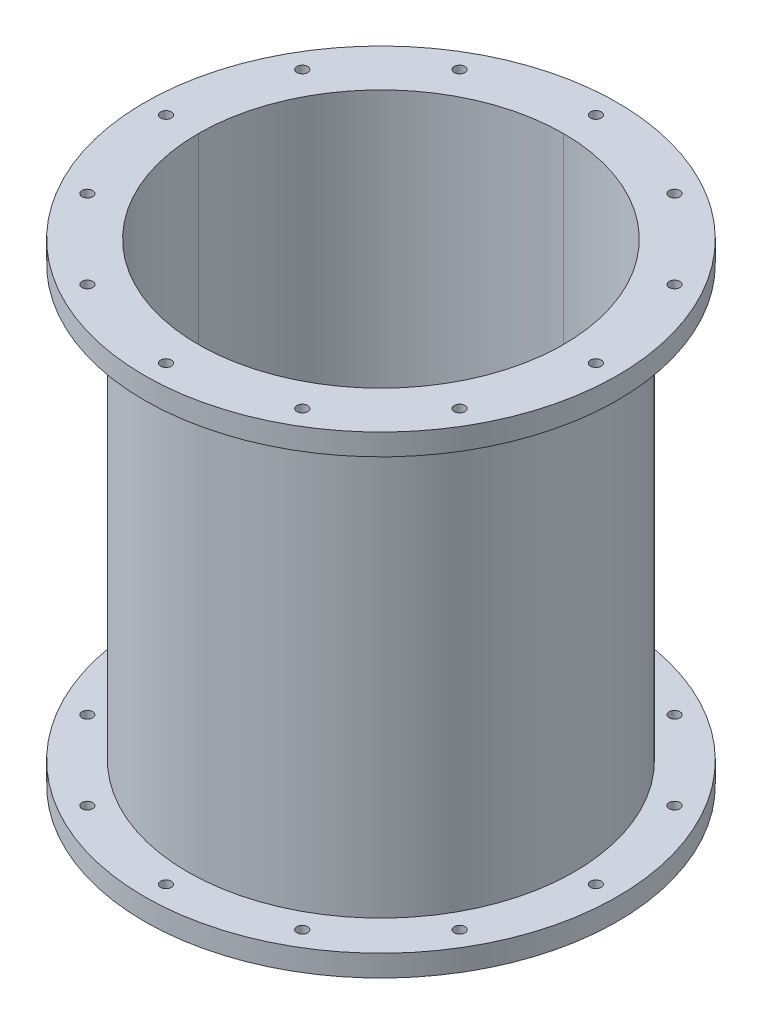
ISO-10303-21;
HEADER;
FILE_DESCRIPTION(('STEP AP214'),'2;1');
FILE_NAME('part.step','',(''),(''),'','','');
FILE_SCHEMA(('AUTOMOTIVE_DESIGN { 1 0 10303 214 1 1 1 1 }'));
ENDSEC;
DATA;
#1=APPLICATION_CONTEXT('core data for automotive mechanical design processes');
#2=APPLICATION_PROTOCOL_DEFINITION('international standard','automotive_design',2000,#1);
#3=PRODUCT_CONTEXT('',#1,'mechanical');
#4=PRODUCT('Part','Part','',(#3));
#5=PRODUCT_RELATED_PRODUCT_CATEGORY('part','',(#4));
#6=PRODUCT_DEFINITION_FORMATION('','',#4);
#7=PRODUCT_DEFINITION_CONTEXT('part definition',#1,'design');
#8=PRODUCT_DEFINITION('design','',#6,#7);
#9=PRODUCT_DEFINITION_SHAPE('','',#8);
#10=(LENGTH_UNIT() NAMED_UNIT(*) SI_UNIT(.MILLI.,.METRE.));
#11=(NAMED_UNIT(*) PLANE_ANGLE_UNIT() SI_UNIT($,.RADIAN.));
#12=(NAMED_UNIT(*) SI_UNIT($,.STERADIAN.) SOLID_ANGLE_UNIT());
#13=UNCERTAINTY_MEASURE_WITH_UNIT(LENGTH_MEASURE(1.E-05),#10,'distance_accuracy_value','');
#14=(GEOMETRIC_REPRESENTATION_CONTEXT(3) GLOBAL_UNCERTAINTY_ASSIGNED_CONTEXT((#13)) GLOBAL_UNIT_ASSIGNED_CONTEXT((#10,
#11,#12)) REPRESENTATION_CONTEXT('',''));
#15=CARTESIAN_POINT('',(0.,0.,0.));
#16=DIRECTION('',(0.,0.,1.));
#17=DIRECTION('',(1.,0.,0.));
#18=AXIS2_PLACEMENT_3D('',#15,#16,#17);
#19=CARTESIAN_POINT('',(109.985226280624,139.7,63.5));
#20=DIRECTION('',(0.,-1.,0.));
#21=DIRECTION('',(0.,0.,-1.));
#22=AXIS2_PLACEMENT_3D('',#19,#20,#21);
#23=CYLINDRICAL_SURFACE('',#22,3.17499999999937);
#24=CARTESIAN_POINT('',(109.985226280624,-139.7,63.5));
#25=DIRECTION('',(0.,1.,0.));
#26=DIRECTION('',(0.,0.,1.));
#27=AXIS2_PLACEMENT_3D('',#24,#25,#26);
#28=CIRCLE('',#27,3.17499999999937);
#29=CARTESIAN_POINT('',(109.985226280624,-139.7,66.6749999999993));
#30=VERTEX_POINT('',#29);
#31=EDGE_CURVE('E157',#30,#30,#28,.T.);
#32=ORIENTED_EDGE('',*,*,#31,.F.);
#33=EDGE_LOOP('',(#32));
#34=FACE_BOUND('',#33,.T.);
#35=CARTESIAN_POINT('',(109.985226280624,-127.,63.5));
#36=DIRECTION('',(0.,1.,0.));
#37=DIRECTION('',(0.,0.,1.));
#38=AXIS2_PLACEMENT_3D('',#35,#36,#37);
#39=CIRCLE('',#38,3.17499999999937);
#40=CARTESIAN_POINT('',(109.985226280624,-127.,66.6749999999993));
#41=VERTEX_POINT('',#40);
#42=EDGE_CURVE('E246',#41,#41,#39,.T.);
#43=ORIENTED_EDGE('',*,*,#42,.T.);
#44=EDGE_LOOP('',(#43));
#45=FACE_BOUND('',#44,.T.);
#46=ADVANCED_FACE('F48',(#34,#45),#23,.F.);
#47=CARTESIAN_POINT('',(63.5,139.7,109.985226280624));
#48=DIRECTION('',(0.,-1.,0.));
#49=DIRECTION('',(0.,0.,-1.));
#50=AXIS2_PLACEMENT_3D('',#47,#48,#49);
#51=CYLINDRICAL_SURFACE('',#50,3.17499999999938);
#52=CARTESIAN_POINT('',(63.5,-139.7,109.985226280624));
#53=DIRECTION('',(0.,1.,0.));
#54=DIRECTION('',(0.,0.,1.));
#55=AXIS2_PLACEMENT_3D('',#52,#53,#54);
#56=CIRCLE('',#55,3.17499999999938);
#57=CARTESIAN_POINT('',(63.5,-139.7,113.160226280623));
#58=VERTEX_POINT('',#57);
#59=EDGE_CURVE('E153',#58,#58,#56,.T.);
#60=ORIENTED_EDGE('',*,*,#59,.F.);
#61=EDGE_LOOP('',(#60));
#62=FACE_BOUND('',#61,.T.);
#63=CARTESIAN_POINT('',(63.5,-127.,109.985226280624));
#64=DIRECTION('',(0.,1.,0.));
#65=DIRECTION('',(0.,0.,1.));
#66=AXIS2_PLACEMENT_3D('',#63,#64,#65);
#67=CIRCLE('',#66,3.17499999999939);
#68=CARTESIAN_POINT('',(63.5,-127.,113.160226280623));
#69=VERTEX_POINT('',#68);
#70=EDGE_CURVE('E256',#69,#69,#67,.T.);
#71=ORIENTED_EDGE('',*,*,#70,.T.);
#72=EDGE_LOOP('',(#71));
#73=FACE_BOUND('',#72,.T.);
#74=ADVANCED_FACE('F184',(#62,#73),#51,.F.);
#75=CARTESIAN_POINT('',(127.,139.7,0.));
#76=DIRECTION('',(0.,-1.,0.));
#77=DIRECTION('',(0.,0.,-1.));
#78=AXIS2_PLACEMENT_3D('',#75,#76,#77);
#79=CYLINDRICAL_SURFACE('',#78,3.175);
#80=CARTESIAN_POINT('',(127.,-139.7,0.));
#81=DIRECTION('',(0.,1.,0.));
#82=DIRECTION('',(0.,0.,1.));
#83=AXIS2_PLACEMENT_3D('',#80,#81,#82);
#84=CIRCLE('',#83,3.175);
#85=CARTESIAN_POINT('',(127.,-139.7,3.175));
#86=VERTEX_POINT('',#85);
#87=EDGE_CURVE('E147',#86,#86,#84,.T.);
#88=ORIENTED_EDGE('',*,*,#87,.F.);
#89=EDGE_LOOP('',(#88));
#90=FACE_BOUND('',#89,.T.);
#91=CARTESIAN_POINT('',(127.,-127.,0.));
#92=DIRECTION('',(0.,1.,0.));
#93=DIRECTION('',(0.,0.,1.));
#94=AXIS2_PLACEMENT_3D('',#91,#92,#93);
#95=CIRCLE('',#94,3.175);
#96=CARTESIAN_POINT('',(127.,-127.,3.175));
#97=VERTEX_POINT('',#96);
#98=EDGE_CURVE('E239',#97,#97,#95,.T.);
#99=ORIENTED_EDGE('',*,*,#98,.T.);
#100=EDGE_LOOP('',(#99));
#101=FACE_BOUND('',#100,.T.);
#102=ADVANCED_FACE('F190',(#90,#101),#79,.F.);
#103=CARTESIAN_POINT('',(63.5,139.7,-109.985226280624));
#104=DIRECTION('',(0.,-1.,0.));
#105=DIRECTION('',(0.,0.,-1.));
#106=AXIS2_PLACEMENT_3D('',#103,#104,#105);
#107=CYLINDRICAL_SURFACE('',#106,3.17499999999933);
#108=CARTESIAN_POINT('',(63.5,-139.7,-109.985226280624));
#109=DIRECTION('',(0.,1.,0.));
#110=DIRECTION('',(0.,0.,1.));
#111=AXIS2_PLACEMENT_3D('',#108,#109,#110);
#112=CIRCLE('',#111,3.17499999999933);
#113=CARTESIAN_POINT('',(63.5,-139.7,-106.810226280624));
#114=VERTEX_POINT('',#113);
#115=EDGE_CURVE('E143',#114,#114,#112,.T.);
#116=ORIENTED_EDGE('',*,*,#115,.F.);
#117=EDGE_LOOP('',(#116));
#118=FACE_BOUND('',#117,.T.);
#119=CARTESIAN_POINT('',(63.5,-127.,-109.985226280624));
#120=DIRECTION('',(0.,1.,0.));
#121=DIRECTION('',(0.,0.,1.));
#122=AXIS2_PLACEMENT_3D('',#119,#120,#121);
#123=CIRCLE('',#122,3.17499999999933);
#124=CARTESIAN_POINT('',(63.5,-127.,-106.810226280624));
#125=VERTEX_POINT('',#124);
#126=EDGE_CURVE('E240',#125,#125,#123,.T.);
#127=ORIENTED_EDGE('',*,*,#126,.T.);
#128=EDGE_LOOP('',(#127));
#129=FACE_BOUND('',#128,.T.);
#130=ADVANCED_FACE('F394',(#118,#129),#107,.F.);
#131=CARTESIAN_POINT('',(-63.5,139.7,109.985226280624));
#132=DIRECTION('',(0.,-1.,0.));
#133=DIRECTION('',(0.,0.,-1.));
#134=AXIS2_PLACEMENT_3D('',#131,#132,#133);
#135=CYLINDRICAL_SURFACE('',#134,3.17499999999984);
#136=CARTESIAN_POINT('',(-63.5,-139.7,109.985226280624));
#137=DIRECTION('',(0.,1.,0.));
#138=DIRECTION('',(0.,0.,1.));
#139=AXIS2_PLACEMENT_3D('',#136,#137,#138);
#140=CIRCLE('',#139,3.17499999999984);
#141=CARTESIAN_POINT('',(-63.5,-139.7,113.160226280624));
#142=VERTEX_POINT('',#141);
#143=EDGE_CURVE('E139',#142,#142,#140,.T.);
#144=ORIENTED_EDGE('',*,*,#143,.F.);
#145=EDGE_LOOP('',(#144));
#146=FACE_BOUND('',#145,.T.);
#147=CARTESIAN_POINT('',(-63.5,-127.,109.985226280624));
#148=DIRECTION('',(0.,1.,0.));
#149=DIRECTION('',(0.,0.,1.));
#150=AXIS2_PLACEMENT_3D('',#147,#148,#149);
#151=CIRCLE('',#150,3.17499999999983);
#152=CARTESIAN_POINT('',(-63.5,-127.,113.160226280624));
#153=VERTEX_POINT('',#152);
#154=EDGE_CURVE('E264',#153,#153,#151,.T.);
#155=ORIENTED_EDGE('',*,*,#154,.T.);
#156=EDGE_LOOP('',(#155));
#157=FACE_BOUND('',#156,.T.);
#158=ADVANCED_FACE('F401',(#146,#157),#135,.F.);
#159=CARTESIAN_POINT('',(-109.985226280624,139.7,63.5000000000001));
#160=DIRECTION('',(0.,-1.,0.));
#161=DIRECTION('',(0.,0.,-1.));
#162=AXIS2_PLACEMENT_3D('',#159,#160,#161);
#163=CYLINDRICAL_SURFACE('',#162,3.17499999999986);
#164=CARTESIAN_POINT('',(-109.985226280624,-139.7,63.5000000000001));
#165=DIRECTION('',(0.,1.,0.));
#166=DIRECTION('',(0.,0.,1.));
#167=AXIS2_PLACEMENT_3D('',#164,#165,#166);
#168=CIRCLE('',#167,3.17499999999986);
#169=CARTESIAN_POINT('',(-109.985226280624,-139.7,66.6749999999999));
#170=VERTEX_POINT('',#169);
#171=EDGE_CURVE('E135',#170,#170,#168,.T.);
#172=ORIENTED_EDGE('',*,*,#171,.F.);
#173=EDGE_LOOP('',(#172));
#174=FACE_BOUND('',#173,.T.);
#175=CARTESIAN_POINT('',(-109.985226280624,-127.,63.5000000000001));
#176=DIRECTION('',(0.,1.,0.));
#177=DIRECTION('',(0.,0.,1.));
#178=AXIS2_PLACEMENT_3D('',#175,#176,#177);
#179=CIRCLE('',#178,3.17499999999985);
#180=CARTESIAN_POINT('',(-109.985226280624,-127.,66.6749999999999));
#181=VERTEX_POINT('',#180);
#182=EDGE_CURVE('E268',#181,#181,#179,.T.);
#183=ORIENTED_EDGE('',*,*,#182,.T.);
#184=EDGE_LOOP('',(#183));
#185=FACE_BOUND('',#184,.T.);
#186=ADVANCED_FACE('F480',(#174,#185),#163,.F.);
#187=CARTESIAN_POINT('',(0.,139.7,127.));
#188=DIRECTION('',(0.,-1.,0.));
#189=DIRECTION('',(0.,0.,-1.));
#190=AXIS2_PLACEMENT_3D('',#187,#188,#189);
#191=CYLINDRICAL_SURFACE('',#190,3.17499999999936);
#192=CARTESIAN_POINT('',(0.,-139.7,127.));
#193=DIRECTION('',(0.,1.,0.));
#194=DIRECTION('',(0.,0.,1.));
#195=AXIS2_PLACEMENT_3D('',#192,#193,#194);
#196=CIRCLE('',#195,3.17499999999936);
#197=CARTESIAN_POINT('',(0.,-139.7,130.174999999999));
#198=VERTEX_POINT('',#197);
#199=EDGE_CURVE('E131',#198,#198,#196,.T.);
#200=ORIENTED_EDGE('',*,*,#199,.F.);
#201=EDGE_LOOP('',(#200));
#202=FACE_BOUND('',#201,.T.);
#203=CARTESIAN_POINT('',(0.,-127.,127.));
#204=DIRECTION('',(0.,1.,0.));
#205=DIRECTION('',(0.,0.,1.));
#206=AXIS2_PLACEMENT_3D('',#203,#204,#205);
#207=CIRCLE('',#206,3.17499999999938);
#208=CARTESIAN_POINT('',(0.,-127.,130.174999999999));
#209=VERTEX_POINT('',#208);
#210=EDGE_CURVE('E260',#209,#209,#207,.T.);
#211=ORIENTED_EDGE('',*,*,#210,.T.);
#212=EDGE_LOOP('',(#211));
#213=FACE_BOUND('',#212,.T.);
#214=ADVANCED_FACE('F445',(#202,#213),#191,.F.);
#215=CARTESIAN_POINT('',(-63.5000000000001,139.7,-109.985226280624));
#216=DIRECTION('',(0.,-1.,0.));
#217=DIRECTION('',(0.,0.,-1.));
#218=AXIS2_PLACEMENT_3D('',#215,#216,#217);
#219=CYLINDRICAL_SURFACE('',#218,3.17499999999999);
#220=CARTESIAN_POINT('',(-63.5000000000001,-139.7,-109.985226280624));
#221=DIRECTION('',(0.,1.,0.));
#222=DIRECTION('',(0.,0.,1.));
#223=AXIS2_PLACEMENT_3D('',#220,#221,#222);
#224=CIRCLE('',#223,3.17499999999999);
#225=CARTESIAN_POINT('',(-63.5000000000001,-139.7,-106.810226280624));
#226=VERTEX_POINT('',#225);
#227=EDGE_CURVE('E127',#226,#226,#224,.T.);
#228=ORIENTED_EDGE('',*,*,#227,.F.);
#229=EDGE_LOOP('',(#228));
#230=FACE_BOUND('',#229,.T.);
#231=CARTESIAN_POINT('',(-63.5000000000001,-127.,-109.985226280624));
#232=DIRECTION('',(0.,1.,0.));
#233=DIRECTION('',(0.,0.,1.));
#234=AXIS2_PLACEMENT_3D('',#231,#232,#233);
#235=CIRCLE('',#234,3.175);
#236=CARTESIAN_POINT('',(-63.5000000000001,-127.,-106.810226280624));
#237=VERTEX_POINT('',#236);
#238=EDGE_CURVE('E340',#237,#237,#235,.T.);
#239=ORIENTED_EDGE('',*,*,#238,.T.);
#240=EDGE_LOOP('',(#239));
#241=FACE_BOUND('',#240,.T.);
#242=ADVANCED_FACE('F434',(#230,#241),#219,.F.);
#243=CARTESIAN_POINT('',(0.,139.7,0.));
#244=DIRECTION('',(0.,-1.,0.));
#245=DIRECTION('',(0.,0.,-1.));
#246=AXIS2_PLACEMENT_3D('',#243,#244,#245);
#247=CYLINDRICAL_SURFACE('',#246,139.7);
#248=CARTESIAN_POINT('',(0.,-139.7,0.));
#249=DIRECTION('',(0.,1.,0.));
#250=DIRECTION('',(0.,0.,1.));
#251=AXIS2_PLACEMENT_3D('',#248,#249,#250);
#252=CIRCLE('',#251,139.7);
#253=CARTESIAN_POINT('',(0.,-139.7,139.7));
#254=VERTEX_POINT('',#253);
#255=EDGE_CURVE('E123',#254,#254,#252,.T.);
#256=ORIENTED_EDGE('',*,*,#255,.T.);
#257=EDGE_LOOP('',(#256));
#258=FACE_BOUND('',#257,.T.);
#259=CARTESIAN_POINT('',(0.,-127.,0.));
#260=DIRECTION('',(0.,1.,0.));
#261=DIRECTION('',(0.,0.,1.));
#262=AXIS2_PLACEMENT_3D('',#259,#260,#261);
#263=CIRCLE('',#262,139.7);
#264=CARTESIAN_POINT('',(0.,-127.,139.7));
#265=VERTEX_POINT('',#264);
#266=EDGE_CURVE('E79',#265,#265,#263,.T.);
#267=ORIENTED_EDGE('',*,*,#266,.F.);
#268=EDGE_LOOP('',(#267));
#269=FACE_BOUND('',#268,.T.);
#270=ADVANCED_FACE('F431',(#258,#269),#247,.T.);
#271=CARTESIAN_POINT('',(-109.985226280624,139.7,-63.4999999999999));
#272=DIRECTION('',(0.,-1.,0.));
#273=DIRECTION('',(0.,0.,-1.));
#274=AXIS2_PLACEMENT_3D('',#271,#272,#273);
#275=CYLINDRICAL_SURFACE('',#274,3.17499999999998);
#276=CARTESIAN_POINT('',(-109.985226280624,-139.7,-63.4999999999999));
#277=DIRECTION('',(0.,1.,0.));
#278=DIRECTION('',(0.,0.,1.));
#279=AXIS2_PLACEMENT_3D('',#276,#277,#278);
#280=CIRCLE('',#279,3.17499999999998);
#281=CARTESIAN_POINT('',(-109.985226280624,-139.7,-60.3249999999999));
#282=VERTEX_POINT('',#281);
#283=EDGE_CURVE('E119',#282,#282,#280,.T.);
#284=ORIENTED_EDGE('',*,*,#283,.F.);
#285=EDGE_LOOP('',(#284));
#286=FACE_BOUND('',#285,.T.);
#287=CARTESIAN_POINT('',(-109.985226280624,-127.,-63.4999999999999));
#288=DIRECTION('',(0.,1.,0.));
#289=DIRECTION('',(0.,0.,1.));
#290=AXIS2_PLACEMENT_3D('',#287,#288,#289);
#291=CIRCLE('',#290,3.17499999999998);
#292=CARTESIAN_POINT('',(-109.985226280624,-127.,-60.3249999999999));
#293=VERTEX_POINT('',#292);
#294=EDGE_CURVE('E276',#293,#293,#291,.T.);
#295=ORIENTED_EDGE('',*,*,#294,.T.);
#296=EDGE_LOOP('',(#295));
#297=FACE_BOUND('',#296,.T.);
#298=ADVANCED_FACE('F433',(#286,#297),#275,.F.);
#299=CARTESIAN_POINT('',(0.,139.7,-127.));
#300=DIRECTION('',(0.,-1.,0.));
#301=DIRECTION('',(0.,0.,-1.));
#302=AXIS2_PLACEMENT_3D('',#299,#300,#301);
#303=CYLINDRICAL_SURFACE('',#302,3.175);
#304=CARTESIAN_POINT('',(0.,-139.7,-127.));
#305=DIRECTION('',(0.,1.,0.));
#306=DIRECTION('',(0.,0.,1.));
#307=AXIS2_PLACEMENT_3D('',#304,#305,#306);
#308=CIRCLE('',#307,3.175);
#309=CARTESIAN_POINT('',(0.,-139.7,-123.825));
#310=VERTEX_POINT('',#309);
#311=EDGE_CURVE('E115',#310,#310,#308,.T.);
#312=ORIENTED_EDGE('',*,*,#311,.F.);
#313=EDGE_LOOP('',(#312));
#314=FACE_BOUND('',#313,.T.);
#315=CARTESIAN_POINT('',(0.,-127.,-127.));
#316=DIRECTION('',(0.,1.,0.));
#317=DIRECTION('',(0.,0.,1.));
#318=AXIS2_PLACEMENT_3D('',#315,#316,#317);
#319=CIRCLE('',#318,3.175);
#320=CARTESIAN_POINT('',(0.,-127.,-123.825));
#321=VERTEX_POINT('',#320);
#322=EDGE_CURVE('E249',#321,#321,#319,.T.);
#323=ORIENTED_EDGE('',*,*,#322,.T.);
#324=EDGE_LOOP('',(#323));
#325=FACE_BOUND('',#324,.T.);
#326=ADVANCED_FACE('F230',(#314,#325),#303,.F.);
#327=CARTESIAN_POINT('',(-127.,139.7,0.));
#328=DIRECTION('',(0.,-1.,0.));
#329=DIRECTION('',(0.,0.,-1.));
#330=AXIS2_PLACEMENT_3D('',#327,#328,#329);
#331=CYLINDRICAL_SURFACE('',#330,3.17499999999995);
#332=CARTESIAN_POINT('',(-127.,-139.7,0.));
#333=DIRECTION('',(0.,1.,0.));
#334=DIRECTION('',(0.,0.,1.));
#335=AXIS2_PLACEMENT_3D('',#332,#333,#334);
#336=CIRCLE('',#335,3.17499999999995);
#337=CARTESIAN_POINT('',(-127.,-139.7,3.17499999999997));
#338=VERTEX_POINT('',#337);
#339=EDGE_CURVE('E78',#338,#338,#336,.T.);
#340=ORIENTED_EDGE('',*,*,#339,.F.);
#341=EDGE_LOOP('',(#340));
#342=FACE_BOUND('',#341,.T.);
#343=CARTESIAN_POINT('',(-127.,-127.,0.));
#344=DIRECTION('',(0.,1.,0.));
#345=DIRECTION('',(0.,0.,1.));
#346=AXIS2_PLACEMENT_3D('',#343,#344,#345);
#347=CIRCLE('',#346,3.17499999999995);
#348=CARTESIAN_POINT('',(-127.,-127.,3.17499999999998));
#349=VERTEX_POINT('',#348);
#350=EDGE_CURVE('E272',#349,#349,#347,.T.);
#351=ORIENTED_EDGE('',*,*,#350,.T.);
#352=EDGE_LOOP('',(#351));
#353=FACE_BOUND('',#352,.T.);
#354=ADVANCED_FACE('F223',(#342,#353),#331,.F.);
#355=CARTESIAN_POINT('',(109.985226280624,139.7,-63.5));
#356=DIRECTION('',(0.,-1.,0.));
#357=DIRECTION('',(0.,0.,-1.));
#358=AXIS2_PLACEMENT_3D('',#355,#356,#357);
#359=CYLINDRICAL_SURFACE('',#358,3.17499999999946);
#360=CARTESIAN_POINT('',(109.985226280624,-139.7,-63.5));
#361=DIRECTION('',(0.,1.,0.));
#362=DIRECTION('',(0.,0.,1.));
#363=AXIS2_PLACEMENT_3D('',#360,#361,#362);
#364=CIRCLE('',#363,3.17499999999946);
#365=CARTESIAN_POINT('',(109.985226280624,-139.7,-60.3250000000005));
#366=VERTEX_POINT('',#365);
#367=EDGE_CURVE('E161',#366,#366,#364,.T.);
#368=ORIENTED_EDGE('',*,*,#367,.F.);
#369=EDGE_LOOP('',(#368));
#370=FACE_BOUND('',#369,.T.);
#371=CARTESIAN_POINT('',(109.985226280624,-127.,-63.5));
#372=DIRECTION('',(0.,1.,0.));
#373=DIRECTION('',(0.,0.,1.));
#374=AXIS2_PLACEMENT_3D('',#371,#372,#373);
#375=CIRCLE('',#374,3.17499999999946);
#376=CARTESIAN_POINT('',(109.985226280624,-127.,-60.3250000000005));
#377=VERTEX_POINT('',#376);
#378=EDGE_CURVE('E236',#377,#377,#375,.T.);
#379=ORIENTED_EDGE('',*,*,#378,.T.);
#380=EDGE_LOOP('',(#379));
#381=FACE_BOUND('',#380,.T.);
#382=ADVANCED_FACE('F178',(#370,#381),#359,.F.);
#383=CARTESIAN_POINT('',(0.,139.7,0.));
#384=DIRECTION('',(0.,1.,0.));
#385=DIRECTION('',(0.,0.,1.));
#386=AXIS2_PLACEMENT_3D('',#383,#384,#385);
#387=PLANE('',#386);
#388=CARTESIAN_POINT('',(-127.,139.7,0.));
#389=DIRECTION('',(0.,1.,0.));
#390=DIRECTION('',(0.,0.,1.));
#391=AXIS2_PLACEMENT_3D('',#388,#389,#390);
#392=CIRCLE('',#391,3.17499999999995);
#393=CARTESIAN_POINT('',(-127.,139.7,3.17499999999997));
#394=VERTEX_POINT('',#393);
#395=EDGE_CURVE('E164',#394,#394,#392,.T.);
#396=ORIENTED_EDGE('',*,*,#395,.F.);
#397=EDGE_LOOP('',(#396));
#398=FACE_BOUND('',#397,.T.);
#399=CARTESIAN_POINT('',(0.,139.7,-127.));
#400=DIRECTION('',(0.,1.,0.));
#401=DIRECTION('',(0.,0.,1.));
#402=AXIS2_PLACEMENT_3D('',#399,#400,#401);
#403=CIRCLE('',#402,3.175);
#404=CARTESIAN_POINT('',(0.,139.7,-123.825));
#405=VERTEX_POINT('',#404);
#406=EDGE_CURVE('E345',#405,#405,#403,.T.);
#407=ORIENTED_EDGE('',*,*,#406,.F.);
#408=EDGE_LOOP('',(#407));
#409=FACE_BOUND('',#408,.T.);
#410=CARTESIAN_POINT('',(-109.985226280624,139.7,-63.4999999999999));
#411=DIRECTION('',(0.,1.,0.));
#412=DIRECTION('',(0.,0.,1.));
#413=AXIS2_PLACEMENT_3D('',#410,#411,#412);
#414=CIRCLE('',#413,3.17499999999998);
#415=CARTESIAN_POINT('',(-109.985226280624,139.7,-60.3249999999999));
#416=VERTEX_POINT('',#415);
#417=EDGE_CURVE('E349',#416,#416,#414,.T.);
#418=ORIENTED_EDGE('',*,*,#417,.F.);
#419=EDGE_LOOP('',(#418));
#420=FACE_BOUND('',#419,.T.);
#421=CARTESIAN_POINT('',(0.,139.7,0.));
#422=DIRECTION('',(0.,1.,0.));
#423=DIRECTION('',(0.,0.,1.));
#424=AXIS2_PLACEMENT_3D('',#421,#422,#423);
#425=CIRCLE('',#424,139.7);
#426=CARTESIAN_POINT('',(0.,139.7,139.7));
#427=VERTEX_POINT('',#426);
#428=EDGE_CURVE('E353',#427,#427,#425,.T.);
#429=ORIENTED_EDGE('',*,*,#428,.T.);
#430=EDGE_LOOP('',(#429));
#431=FACE_BOUND('',#430,.T.);
#432=CARTESIAN_POINT('',(-63.5000000000001,139.7,-109.985226280624));
#433=DIRECTION('',(0.,1.,0.));
#434=DIRECTION('',(0.,0.,1.));
#435=AXIS2_PLACEMENT_3D('',#432,#433,#434);
#436=CIRCLE('',#435,3.17499999999999);
#437=CARTESIAN_POINT('',(-63.5000000000001,139.7,-106.810226280624));
#438=VERTEX_POINT('',#437);
#439=EDGE_CURVE('E357',#438,#438,#436,.T.);
#440=ORIENTED_EDGE('',*,*,#439,.F.);
#441=EDGE_LOOP('',(#440));
#442=FACE_BOUND('',#441,.T.);
#443=CARTESIAN_POINT('',(0.,139.7,127.));
#444=DIRECTION('',(0.,1.,0.));
#445=DIRECTION('',(0.,0.,1.));
#446=AXIS2_PLACEMENT_3D('',#443,#444,#445);
#447=CIRCLE('',#446,3.17499999999936);
#448=CARTESIAN_POINT('',(0.,139.7,130.174999999999));
#449=VERTEX_POINT('',#448);
#450=EDGE_CURVE('E361',#449,#449,#447,.T.);
#451=ORIENTED_EDGE('',*,*,#450,.F.);
#452=EDGE_LOOP('',(#451));
#453=FACE_BOUND('',#452,.T.);
#454=CARTESIAN_POINT('',(-109.985226280624,139.7,63.5000000000001));
#455=DIRECTION('',(0.,1.,0.));
#456=DIRECTION('',(0.,0.,1.));
#457=AXIS2_PLACEMENT_3D('',#454,#455,#456);
#458=CIRCLE('',#457,3.17499999999986);
#459=CARTESIAN_POINT('',(-109.985226280624,139.7,66.6749999999999));
#460=VERTEX_POINT('',#459);
#461=EDGE_CURVE('E365',#460,#460,#458,.T.);
#462=ORIENTED_EDGE('',*,*,#461,.F.);
#463=EDGE_LOOP('',(#462));
#464=FACE_BOUND('',#463,.T.);
#465=CARTESIAN_POINT('',(-63.5,139.7,109.985226280624));
#466=DIRECTION('',(0.,1.,0.));
#467=DIRECTION('',(0.,0.,1.));
#468=AXIS2_PLACEMENT_3D('',#465,#466,#467);
#469=CIRCLE('',#468,3.17499999999984);
#470=CARTESIAN_POINT('',(-63.5,139.7,113.160226280624));
#471=VERTEX_POINT('',#470);
#472=EDGE_CURVE('E369',#471,#471,#469,.T.);
#473=ORIENTED_EDGE('',*,*,#472,.F.);
#474=EDGE_LOOP('',(#473));
#475=FACE_BOUND('',#474,.T.);
#476=CARTESIAN_POINT('',(63.5,139.7,-109.985226280624));
#477=DIRECTION('',(0.,1.,0.));
#478=DIRECTION('',(0.,0.,1.));
#479=AXIS2_PLACEMENT_3D('',#476,#477,#478);
#480=CIRCLE('',#479,3.17499999999933);
#481=CARTESIAN_POINT('',(63.5,139.7,-106.810226280624));
#482=VERTEX_POINT('',#481);
#483=EDGE_CURVE('E102',#482,#482,#480,.T.);
#484=ORIENTED_EDGE('',*,*,#483,.F.);
#485=EDGE_LOOP('',(#484));
#486=FACE_BOUND('',#485,.T.);
#487=CARTESIAN_POINT('',(127.,139.7,0.));
#488=DIRECTION('',(0.,1.,0.));
#489=DIRECTION('',(0.,0.,1.));
#490=AXIS2_PLACEMENT_3D('',#487,#488,#489);
#491=CIRCLE('',#490,3.175);
#492=CARTESIAN_POINT('',(127.,139.7,3.175));
#493=VERTEX_POINT('',#492);
#494=EDGE_CURVE('E93',#493,#493,#491,.T.);
#495=ORIENTED_EDGE('',*,*,#494,.F.);
#496=EDGE_LOOP('',(#495));
#497=FACE_BOUND('',#496,.T.);
#498=CARTESIAN_POINT('',(63.5,139.7,109.985226280624));
#499=DIRECTION('',(0.,1.,0.));
#500=DIRECTION('',(0.,0.,1.));
#501=AXIS2_PLACEMENT_3D('',#498,#499,#500);
#502=CIRCLE('',#501,3.17499999999938);
#503=CARTESIAN_POINT('',(63.5,139.7,113.160226280623));
#504=VERTEX_POINT('',#503);
#505=EDGE_CURVE('E92',#504,#504,#502,.T.);
#506=ORIENTED_EDGE('',*,*,#505,.F.);
#507=EDGE_LOOP('',(#506));
#508=FACE_BOUND('',#507,.T.);
#509=CARTESIAN_POINT('',(109.985226280624,139.7,63.5));
#510=DIRECTION('',(0.,1.,0.));
#511=DIRECTION('',(0.,0.,1.));
#512=AXIS2_PLACEMENT_3D('',#509,#510,#511);
#513=CIRCLE('',#512,3.17499999999937);
#514=CARTESIAN_POINT('',(109.985226280624,139.7,66.6749999999993));
#515=VERTEX_POINT('',#514);
#516=EDGE_CURVE('E99',#515,#515,#513,.T.);
#517=ORIENTED_EDGE('',*,*,#516,.F.);
#518=EDGE_LOOP('',(#517));
#519=FACE_BOUND('',#518,.T.);
#520=CARTESIAN_POINT('',(109.985226280624,139.7,-63.5));
#521=DIRECTION('',(0.,1.,0.));
#522=DIRECTION('',(0.,0.,1.));
#523=AXIS2_PLACEMENT_3D('',#520,#521,#522);
#524=CIRCLE('',#523,3.17499999999946);
#525=CARTESIAN_POINT('',(109.985226280624,139.7,-60.3250000000005));
#526=VERTEX_POINT('',#525);
#527=EDGE_CURVE('E88',#526,#526,#524,.T.);
#528=ORIENTED_EDGE('',*,*,#527,.F.);
#529=EDGE_LOOP('',(#528));
#530=FACE_BOUND('',#529,.T.);
#531=CARTESIAN_POINT('',(0.,139.7,0.));
#532=DIRECTION('',(0.,1.,0.));
#533=DIRECTION('',(0.,0.,1.));
#534=AXIS2_PLACEMENT_3D('',#531,#532,#533);
#535=CIRCLE('',#534,107.95);
#536=CARTESIAN_POINT('',(0.,139.7,-107.95));
#537=VERTEX_POINT('',#536);
#538=CARTESIAN_POINT('',(-107.95,139.7,0.));
#539=VERTEX_POINT('',#538);
#540=EDGE_CURVE('E84',#537,#539,#535,.T.);
#541=ORIENTED_EDGE('',*,*,#540,.F.);
#542=CARTESIAN_POINT('',(0.,139.7,0.));
#543=DIRECTION('',(0.,1.,0.));
#544=DIRECTION('',(0.,0.,1.));
#545=AXIS2_PLACEMENT_3D('',#542,#543,#544);
#546=CIRCLE('',#545,107.95);
#547=EDGE_CURVE('E72',#539,#537,#546,.T.);
#548=ORIENTED_EDGE('',*,*,#547,.F.);
#549=EDGE_LOOP('',(#541,#548));
#550=FACE_BOUND('',#549,.T.);
#551=ADVANCED_FACE('F90',(#398,#409,#420,#431,#442,#453,#464,#475,#486,#497,#508,#519,#530,
#550),#387,.T.);
#552=CARTESIAN_POINT('',(0.,-139.7,0.));
#553=DIRECTION('',(0.,1.,0.));
#554=DIRECTION('',(0.,0.,1.));
#555=AXIS2_PLACEMENT_3D('',#552,#553,#554);
#556=PLANE('',#555);
#557=ORIENTED_EDGE('',*,*,#367,.T.);
#558=EDGE_LOOP('',(#557));
#559=FACE_BOUND('',#558,.T.);
#560=ORIENTED_EDGE('',*,*,#31,.T.);
#561=EDGE_LOOP('',(#560));
#562=FACE_BOUND('',#561,.T.);
#563=ORIENTED_EDGE('',*,*,#59,.T.);
#564=EDGE_LOOP('',(#563));
#565=FACE_BOUND('',#564,.T.);
#566=ORIENTED_EDGE('',*,*,#87,.T.);
#567=EDGE_LOOP('',(#566));
#568=FACE_BOUND('',#567,.T.);
#569=ORIENTED_EDGE('',*,*,#115,.T.);
#570=EDGE_LOOP('',(#569));
#571=FACE_BOUND('',#570,.T.);
#572=ORIENTED_EDGE('',*,*,#143,.T.);
#573=EDGE_LOOP('',(#572));
#574=FACE_BOUND('',#573,.T.);
#575=ORIENTED_EDGE('',*,*,#171,.T.);
#576=EDGE_LOOP('',(#575));
#577=FACE_BOUND('',#576,.T.);
#578=ORIENTED_EDGE('',*,*,#199,.T.);
#579=EDGE_LOOP('',(#578));
#580=FACE_BOUND('',#579,.T.);
#581=ORIENTED_EDGE('',*,*,#227,.T.);
#582=EDGE_LOOP('',(#581));
#583=FACE_BOUND('',#582,.T.);
#584=ORIENTED_EDGE('',*,*,#255,.F.);
#585=EDGE_LOOP('',(#584));
#586=FACE_BOUND('',#585,.T.);
#587=ORIENTED_EDGE('',*,*,#283,.T.);
#588=EDGE_LOOP('',(#587));
#589=FACE_BOUND('',#588,.T.);
#590=ORIENTED_EDGE('',*,*,#311,.T.);
#591=EDGE_LOOP('',(#590));
#592=FACE_BOUND('',#591,.T.);
#593=ORIENTED_EDGE('',*,*,#339,.T.);
#594=EDGE_LOOP('',(#593));
#595=FACE_BOUND('',#594,.T.);
#596=CARTESIAN_POINT('',(0.,-139.7,0.));
#597=DIRECTION('',(0.,1.,0.));
#598=DIRECTION('',(0.,0.,1.));
#599=AXIS2_PLACEMENT_3D('',#596,#597,#598);
#600=CIRCLE('',#599,107.95);
#601=CARTESIAN_POINT('',(0.,-139.7,-107.95));
#602=VERTEX_POINT('',#601);
#603=CARTESIAN_POINT('',(-107.95,-139.7,0.));
#604=VERTEX_POINT('',#603);
#605=EDGE_CURVE('E12',#602,#604,#600,.F.);
#606=ORIENTED_EDGE('',*,*,#605,.F.);
#607=CARTESIAN_POINT('',(0.,-139.7,0.));
#608=DIRECTION('',(0.,1.,0.));
#609=DIRECTION('',(0.,0.,1.));
#610=AXIS2_PLACEMENT_3D('',#607,#608,#609);
#611=CIRCLE('',#610,107.95);
#612=EDGE_CURVE('E86',#602,#604,#611,.T.);
#613=ORIENTED_EDGE('',*,*,#612,.T.);
#614=EDGE_LOOP('',(#606,#613));
#615=FACE_BOUND('',#614,.T.);
#616=ADVANCED_FACE('F168',(#559,#562,#565,#568,#571,#574,#577,#580,#583,#586,#589,#592,#595,
#615),#556,.F.);
#617=CARTESIAN_POINT('',(0.,139.7,0.));
#618=DIRECTION('',(0.,-1.,0.));
#619=DIRECTION('',(0.,0.,-1.));
#620=AXIS2_PLACEMENT_3D('',#617,#618,#619);
#621=CYLINDRICAL_SURFACE('',#620,107.95);
#622=ORIENTED_EDGE('',*,*,#612,.F.);
#623=DIRECTION('',(0.,-1.,0.));
#624=VECTOR('',#623,1.);
#625=CARTESIAN_POINT('',(0.,139.7,-107.95));
#626=LINE('',#625,#624);
#627=EDGE_CURVE('E63',#537,#602,#626,.T.);
#628=ORIENTED_EDGE('',*,*,#627,.F.);
#629=ORIENTED_EDGE('',*,*,#540,.T.);
#630=DIRECTION('',(0.,-1.,0.));
#631=VECTOR('',#630,1.);
#632=CARTESIAN_POINT('',(-107.95,139.7,0.));
#633=LINE('',#632,#631);
#634=EDGE_CURVE('E57',#539,#604,#633,.T.);
#635=ORIENTED_EDGE('',*,*,#634,.T.);
#636=EDGE_LOOP('',(#622,#628,#629,#635));
#637=FACE_BOUND('',#636,.T.);
#638=ADVANCED_FACE('F83',(#637),#621,.F.);
#639=CARTESIAN_POINT('',(109.985226280624,127.,63.5));
#640=DIRECTION('',(0.,1.,0.));
#641=DIRECTION('',(0.,0.,1.));
#642=AXIS2_PLACEMENT_3D('',#639,#640,#641);
#643=CIRCLE('',#642,3.17499999999937);
#644=CARTESIAN_POINT('',(109.985226280624,127.,66.6749999999993));
#645=VERTEX_POINT('',#644);
#646=EDGE_CURVE('E206',#645,#645,#643,.T.);
#647=ORIENTED_EDGE('',*,*,#646,.F.);
#648=EDGE_LOOP('',(#647));
#649=FACE_BOUND('',#648,.T.);
#650=ORIENTED_EDGE('',*,*,#516,.T.);
#651=EDGE_LOOP('',(#650));
#652=FACE_BOUND('',#651,.T.);
#653=ADVANCED_FACE('F176',(#649,#652),#23,.F.);
#654=CARTESIAN_POINT('',(63.5,127.,109.985226280624));
#655=DIRECTION('',(0.,1.,0.));
#656=DIRECTION('',(0.,0.,1.));
#657=AXIS2_PLACEMENT_3D('',#654,#655,#656);
#658=CIRCLE('',#657,3.17499999999939);
#659=CARTESIAN_POINT('',(63.5,127.,113.160226280623));
#660=VERTEX_POINT('',#659);
#661=EDGE_CURVE('E309',#660,#660,#658,.T.);
#662=ORIENTED_EDGE('',*,*,#661,.F.);
#663=EDGE_LOOP('',(#662));
#664=FACE_BOUND('',#663,.T.);
#665=ORIENTED_EDGE('',*,*,#505,.T.);
#666=EDGE_LOOP('',(#665));
#667=FACE_BOUND('',#666,.T.);
#668=ADVANCED_FACE('F193',(#664,#667),#51,.F.);
#669=CARTESIAN_POINT('',(127.,127.,0.));
#670=DIRECTION('',(0.,1.,0.));
#671=DIRECTION('',(0.,0.,1.));
#672=AXIS2_PLACEMENT_3D('',#669,#670,#671);
#673=CIRCLE('',#672,3.175);
#674=CARTESIAN_POINT('',(127.,127.,3.175));
#675=VERTEX_POINT('',#674);
#676=EDGE_CURVE('E303',#675,#675,#673,.T.);
#677=ORIENTED_EDGE('',*,*,#676,.F.);
#678=EDGE_LOOP('',(#677));
#679=FACE_BOUND('',#678,.T.);
#680=ORIENTED_EDGE('',*,*,#494,.T.);
#681=EDGE_LOOP('',(#680));
#682=FACE_BOUND('',#681,.T.);
#683=ADVANCED_FACE('F201',(#679,#682),#79,.F.);
#684=CARTESIAN_POINT('',(63.5,127.,-109.985226280624));
#685=DIRECTION('',(0.,1.,0.));
#686=DIRECTION('',(0.,0.,1.));
#687=AXIS2_PLACEMENT_3D('',#684,#685,#686);
#688=CIRCLE('',#687,3.17499999999933);
#689=CARTESIAN_POINT('',(63.5,127.,-106.810226280624));
#690=VERTEX_POINT('',#689);
#691=EDGE_CURVE('E295',#690,#690,#688,.T.);
#692=ORIENTED_EDGE('',*,*,#691,.F.);
#693=EDGE_LOOP('',(#692));
#694=FACE_BOUND('',#693,.T.);
#695=ORIENTED_EDGE('',*,*,#483,.T.);
#696=EDGE_LOOP('',(#695));
#697=FACE_BOUND('',#696,.T.);
#698=ADVANCED_FACE('F377',(#694,#697),#107,.F.);
#699=CARTESIAN_POINT('',(-63.5,127.,109.985226280624));
#700=DIRECTION('',(0.,1.,0.));
#701=DIRECTION('',(0.,0.,1.));
#702=AXIS2_PLACEMENT_3D('',#699,#700,#701);
#703=CIRCLE('',#702,3.17499999999983);
#704=CARTESIAN_POINT('',(-63.5,127.,113.160226280624));
#705=VERTEX_POINT('',#704);
#706=EDGE_CURVE('E317',#705,#705,#703,.T.);
#707=ORIENTED_EDGE('',*,*,#706,.F.);
#708=EDGE_LOOP('',(#707));
#709=FACE_BOUND('',#708,.T.);
#710=ORIENTED_EDGE('',*,*,#472,.T.);
#711=EDGE_LOOP('',(#710));
#712=FACE_BOUND('',#711,.T.);
#713=ADVANCED_FACE('F391',(#709,#712),#135,.F.);
#714=CARTESIAN_POINT('',(-109.985226280624,127.,63.5000000000001));
#715=DIRECTION('',(0.,1.,0.));
#716=DIRECTION('',(0.,0.,1.));
#717=AXIS2_PLACEMENT_3D('',#714,#715,#716);
#718=CIRCLE('',#717,3.17499999999985);
#719=CARTESIAN_POINT('',(-109.985226280624,127.,66.6749999999999));
#720=VERTEX_POINT('',#719);
#721=EDGE_CURVE('E321',#720,#720,#718,.T.);
#722=ORIENTED_EDGE('',*,*,#721,.F.);
#723=EDGE_LOOP('',(#722));
#724=FACE_BOUND('',#723,.T.);
#725=ORIENTED_EDGE('',*,*,#461,.T.);
#726=EDGE_LOOP('',(#725));
#727=FACE_BOUND('',#726,.T.);
#728=ADVANCED_FACE('F472',(#724,#727),#163,.F.);
#729=CARTESIAN_POINT('',(0.,127.,127.));
#730=DIRECTION('',(0.,1.,0.));
#731=DIRECTION('',(0.,0.,1.));
#732=AXIS2_PLACEMENT_3D('',#729,#730,#731);
#733=CIRCLE('',#732,3.17499999999938);
#734=CARTESIAN_POINT('',(0.,127.,130.174999999999));
#735=VERTEX_POINT('',#734);
#736=EDGE_CURVE('E313',#735,#735,#733,.T.);
#737=ORIENTED_EDGE('',*,*,#736,.F.);
#738=EDGE_LOOP('',(#737));
#739=FACE_BOUND('',#738,.T.);
#740=ORIENTED_EDGE('',*,*,#450,.T.);
#741=EDGE_LOOP('',(#740));
#742=FACE_BOUND('',#741,.T.);
#743=ADVANCED_FACE('F456',(#739,#742),#191,.F.);
#744=CARTESIAN_POINT('',(-63.5000000000001,127.,-109.985226280624));
#745=DIRECTION('',(0.,1.,0.));
#746=DIRECTION('',(0.,0.,1.));
#747=AXIS2_PLACEMENT_3D('',#744,#745,#746);
#748=CIRCLE('',#747,3.175);
#749=CARTESIAN_POINT('',(-63.5000000000001,127.,-106.810226280624));
#750=VERTEX_POINT('',#749);
#751=EDGE_CURVE('E287',#750,#750,#748,.T.);
#752=ORIENTED_EDGE('',*,*,#751,.F.);
#753=EDGE_LOOP('',(#752));
#754=FACE_BOUND('',#753,.T.);
#755=ORIENTED_EDGE('',*,*,#439,.T.);
#756=EDGE_LOOP('',(#755));
#757=FACE_BOUND('',#756,.T.);
#758=ADVANCED_FACE('F448',(#754,#757),#219,.F.);
#759=CARTESIAN_POINT('',(0.,127.,0.));
#760=DIRECTION('',(0.,1.,0.));
#761=DIRECTION('',(0.,0.,1.));
#762=AXIS2_PLACEMENT_3D('',#759,#760,#761);
#763=CIRCLE('',#762,139.7);
#764=CARTESIAN_POINT('',(0.,127.,139.7));
#765=VERTEX_POINT('',#764);
#766=EDGE_CURVE('E337',#765,#765,#763,.T.);
#767=ORIENTED_EDGE('',*,*,#766,.T.);
#768=EDGE_LOOP('',(#767));
#769=FACE_BOUND('',#768,.T.);
#770=ORIENTED_EDGE('',*,*,#428,.F.);
#771=EDGE_LOOP('',(#770));
#772=FACE_BOUND('',#771,.T.);
#773=ADVANCED_FACE('F437',(#769,#772),#247,.T.);
#774=CARTESIAN_POINT('',(-109.985226280624,127.,-63.4999999999999));
#775=DIRECTION('',(0.,1.,0.));
#776=DIRECTION('',(0.,0.,1.));
#777=AXIS2_PLACEMENT_3D('',#774,#775,#776);
#778=CIRCLE('',#777,3.17499999999998);
#779=CARTESIAN_POINT('',(-109.985226280624,127.,-60.3249999999999));
#780=VERTEX_POINT('',#779);
#781=EDGE_CURVE('E329',#780,#780,#778,.T.);
#782=ORIENTED_EDGE('',*,*,#781,.F.);
#783=EDGE_LOOP('',(#782));
#784=FACE_BOUND('',#783,.T.);
#785=ORIENTED_EDGE('',*,*,#417,.T.);
#786=EDGE_LOOP('',(#785));
#787=FACE_BOUND('',#786,.T.);
#788=ADVANCED_FACE('F444',(#784,#787),#275,.F.);
#789=CARTESIAN_POINT('',(0.,127.,-127.));
#790=DIRECTION('',(0.,1.,0.));
#791=DIRECTION('',(0.,0.,1.));
#792=AXIS2_PLACEMENT_3D('',#789,#790,#791);
#793=CIRCLE('',#792,3.175);
#794=CARTESIAN_POINT('',(0.,127.,-123.825));
#795=VERTEX_POINT('',#794);
#796=EDGE_CURVE('E291',#795,#795,#793,.T.);
#797=ORIENTED_EDGE('',*,*,#796,.F.);
#798=EDGE_LOOP('',(#797));
#799=FACE_BOUND('',#798,.T.);
#800=ORIENTED_EDGE('',*,*,#406,.T.);
#801=EDGE_LOOP('',(#800));
#802=FACE_BOUND('',#801,.T.);
#803=ADVANCED_FACE('F221',(#799,#802),#303,.F.);
#804=CARTESIAN_POINT('',(-127.,127.,0.));
#805=DIRECTION('',(0.,1.,0.));
#806=DIRECTION('',(0.,0.,1.));
#807=AXIS2_PLACEMENT_3D('',#804,#805,#806);
#808=CIRCLE('',#807,3.17499999999995);
#809=CARTESIAN_POINT('',(-127.,127.,3.17499999999998));
#810=VERTEX_POINT('',#809);
#811=EDGE_CURVE('E325',#810,#810,#808,.T.);
#812=ORIENTED_EDGE('',*,*,#811,.F.);
#813=EDGE_LOOP('',(#812));
#814=FACE_BOUND('',#813,.T.);
#815=ORIENTED_EDGE('',*,*,#395,.T.);
#816=EDGE_LOOP('',(#815));
#817=FACE_BOUND('',#816,.T.);
#818=ADVANCED_FACE('F50',(#814,#817),#331,.F.);
#819=CARTESIAN_POINT('',(109.985226280624,127.,-63.5));
#820=DIRECTION('',(0.,1.,0.));
#821=DIRECTION('',(0.,0.,1.));
#822=AXIS2_PLACEMENT_3D('',#819,#820,#821);
#823=CIRCLE('',#822,3.17499999999946);
#824=CARTESIAN_POINT('',(109.985226280624,127.,-60.3250000000005));
#825=VERTEX_POINT('',#824);
#826=EDGE_CURVE('E299',#825,#825,#823,.T.);
#827=ORIENTED_EDGE('',*,*,#826,.F.);
#828=EDGE_LOOP('',(#827));
#829=FACE_BOUND('',#828,.T.);
#830=ORIENTED_EDGE('',*,*,#527,.T.);
#831=EDGE_LOOP('',(#830));
#832=FACE_BOUND('',#831,.T.);
#833=ADVANCED_FACE('F212',(#829,#832),#359,.F.);
#834=CARTESIAN_POINT('',(0.,139.7,0.));
#835=DIRECTION('',(0.,-1.,0.));
#836=DIRECTION('',(0.,0.,-1.));
#837=AXIS2_PLACEMENT_3D('',#834,#835,#836);
#838=CYLINDRICAL_SURFACE('',#837,107.95);
#839=ORIENTED_EDGE('',*,*,#547,.T.);
#840=ORIENTED_EDGE('',*,*,#627,.T.);
#841=ORIENTED_EDGE('',*,*,#605,.T.);
#842=ORIENTED_EDGE('',*,*,#634,.F.);
#843=EDGE_LOOP('',(#839,#840,#841,#842));
#844=FACE_BOUND('',#843,.T.);
#845=ADVANCED_FACE('F73',(#844),#838,.F.);
#846=CARTESIAN_POINT('',(0.,-127.,0.));
#847=DIRECTION('',(0.,1.,0.));
#848=DIRECTION('',(0.,0.,1.));
#849=AXIS2_PLACEMENT_3D('',#846,#847,#848);
#850=CYLINDRICAL_SURFACE('',#849,114.286339030771);
#851=CARTESIAN_POINT('',(0.,-127.,0.));
#852=DIRECTION('',(0.,1.,0.));
#853=DIRECTION('',(0.,0.,1.));
#854=AXIS2_PLACEMENT_3D('',#851,#852,#853);
#855=CIRCLE('',#854,114.286339030771);
#856=CARTESIAN_POINT('',(0.,-127.,114.286339030771));
#857=VERTEX_POINT('',#856);
#858=EDGE_CURVE('E280',#857,#857,#855,.T.);
#859=ORIENTED_EDGE('',*,*,#858,.T.);
#860=EDGE_LOOP('',(#859));
#861=FACE_BOUND('',#860,.T.);
#862=CARTESIAN_POINT('',(0.,127.,0.));
#863=DIRECTION('',(0.,1.,0.));
#864=DIRECTION('',(0.,0.,1.));
#865=AXIS2_PLACEMENT_3D('',#862,#863,#864);
#866=CIRCLE('',#865,114.286339030771);
#867=CARTESIAN_POINT('',(0.,127.,114.286339030771));
#868=VERTEX_POINT('',#867);
#869=EDGE_CURVE('E333',#868,#868,#866,.T.);
#870=ORIENTED_EDGE('',*,*,#869,.F.);
#871=EDGE_LOOP('',(#870));
#872=FACE_BOUND('',#871,.T.);
#873=ADVANCED_FACE('F219',(#861,#872),#850,.T.);
#874=CARTESIAN_POINT('',(0.,-127.,0.));
#875=DIRECTION('',(0.,1.,0.));
#876=DIRECTION('',(0.,0.,1.));
#877=AXIS2_PLACEMENT_3D('',#874,#875,#876);
#878=PLANE('',#877);
#879=ORIENTED_EDGE('',*,*,#238,.F.);
#880=EDGE_LOOP('',(#879));
#881=FACE_BOUND('',#880,.T.);
#882=ORIENTED_EDGE('',*,*,#322,.F.);
#883=EDGE_LOOP('',(#882));
#884=FACE_BOUND('',#883,.T.);
#885=ORIENTED_EDGE('',*,*,#126,.F.);
#886=EDGE_LOOP('',(#885));
#887=FACE_BOUND('',#886,.T.);
#888=ORIENTED_EDGE('',*,*,#378,.F.);
#889=EDGE_LOOP('',(#888));
#890=FACE_BOUND('',#889,.T.);
#891=ORIENTED_EDGE('',*,*,#98,.F.);
#892=EDGE_LOOP('',(#891));
#893=FACE_BOUND('',#892,.T.);
#894=ORIENTED_EDGE('',*,*,#42,.F.);
#895=EDGE_LOOP('',(#894));
#896=FACE_BOUND('',#895,.T.);
#897=ORIENTED_EDGE('',*,*,#70,.F.);
#898=EDGE_LOOP('',(#897));
#899=FACE_BOUND('',#898,.T.);
#900=ORIENTED_EDGE('',*,*,#210,.F.);
#901=EDGE_LOOP('',(#900));
#902=FACE_BOUND('',#901,.T.);
#903=ORIENTED_EDGE('',*,*,#154,.F.);
#904=EDGE_LOOP('',(#903));
#905=FACE_BOUND('',#904,.T.);
#906=ORIENTED_EDGE('',*,*,#182,.F.);
#907=EDGE_LOOP('',(#906));
#908=FACE_BOUND('',#907,.T.);
#909=ORIENTED_EDGE('',*,*,#350,.F.);
#910=EDGE_LOOP('',(#909));
#911=FACE_BOUND('',#910,.T.);
#912=ORIENTED_EDGE('',*,*,#294,.F.);
#913=EDGE_LOOP('',(#912));
#914=FACE_BOUND('',#913,.T.);
#915=ORIENTED_EDGE('',*,*,#858,.F.);
#916=EDGE_LOOP('',(#915));
#917=FACE_BOUND('',#916,.T.);
#918=ORIENTED_EDGE('',*,*,#266,.T.);
#919=EDGE_LOOP('',(#918));
#920=FACE_BOUND('',#919,.T.);
#921=ADVANCED_FACE('F407',(#881,#884,#887,#890,#893,#896,#899,#902,#905,#908,#911,#914,#917,
#920),#878,.T.);
#922=CARTESIAN_POINT('',(0.,127.,0.));
#923=DIRECTION('',(0.,1.,0.));
#924=DIRECTION('',(0.,0.,1.));
#925=AXIS2_PLACEMENT_3D('',#922,#923,#924);
#926=PLANE('',#925);
#927=ORIENTED_EDGE('',*,*,#751,.T.);
#928=EDGE_LOOP('',(#927));
#929=FACE_BOUND('',#928,.T.);
#930=ORIENTED_EDGE('',*,*,#796,.T.);
#931=EDGE_LOOP('',(#930));
#932=FACE_BOUND('',#931,.T.);
#933=ORIENTED_EDGE('',*,*,#691,.T.);
#934=EDGE_LOOP('',(#933));
#935=FACE_BOUND('',#934,.T.);
#936=ORIENTED_EDGE('',*,*,#826,.T.);
#937=EDGE_LOOP('',(#936));
#938=FACE_BOUND('',#937,.T.);
#939=ORIENTED_EDGE('',*,*,#676,.T.);
#940=EDGE_LOOP('',(#939));
#941=FACE_BOUND('',#940,.T.);
#942=ORIENTED_EDGE('',*,*,#646,.T.);
#943=EDGE_LOOP('',(#942));
#944=FACE_BOUND('',#943,.T.);
#945=ORIENTED_EDGE('',*,*,#661,.T.);
#946=EDGE_LOOP('',(#945));
#947=FACE_BOUND('',#946,.T.);
#948=ORIENTED_EDGE('',*,*,#736,.T.);
#949=EDGE_LOOP('',(#948));
#950=FACE_BOUND('',#949,.T.);
#951=ORIENTED_EDGE('',*,*,#706,.T.);
#952=EDGE_LOOP('',(#951));
#953=FACE_BOUND('',#952,.T.);
#954=ORIENTED_EDGE('',*,*,#721,.T.);
#955=EDGE_LOOP('',(#954));
#956=FACE_BOUND('',#955,.T.);
#957=ORIENTED_EDGE('',*,*,#811,.T.);
#958=EDGE_LOOP('',(#957));
#959=FACE_BOUND('',#958,.T.);
#960=ORIENTED_EDGE('',*,*,#781,.T.);
#961=EDGE_LOOP('',(#960));
#962=FACE_BOUND('',#961,.T.);
#963=ORIENTED_EDGE('',*,*,#869,.T.);
#964=EDGE_LOOP('',(#963));
#965=FACE_BOUND('',#964,.T.);
#966=ORIENTED_EDGE('',*,*,#766,.F.);
#967=EDGE_LOOP('',(#966));
#968=FACE_BOUND('',#967,.T.);
#969=ADVANCED_FACE('F410',(#929,#932,#935,#938,#941,#944,#947,#950,#953,#956,#959,#962,#965,
#968),#926,.F.);
#970=CLOSED_SHELL('',(#46,#74,#102,#130,#158,#186,#214,#242,#270,#298,#326,#354,#382,#551,#616,
#638,#653,#668,#683,#698,#713,#728,#743,#758,#773,#788,#803,#818,#833,#845,#873,#921,#969));
#971=MANIFOLD_SOLID_BREP('B2',#970);
#972=ADVANCED_BREP_SHAPE_REPRESENTATION('',(#18,#971),#14);
#973=SHAPE_DEFINITION_REPRESENTATION(#9,#972);
ENDSEC;
END-ISO-10303-21;
